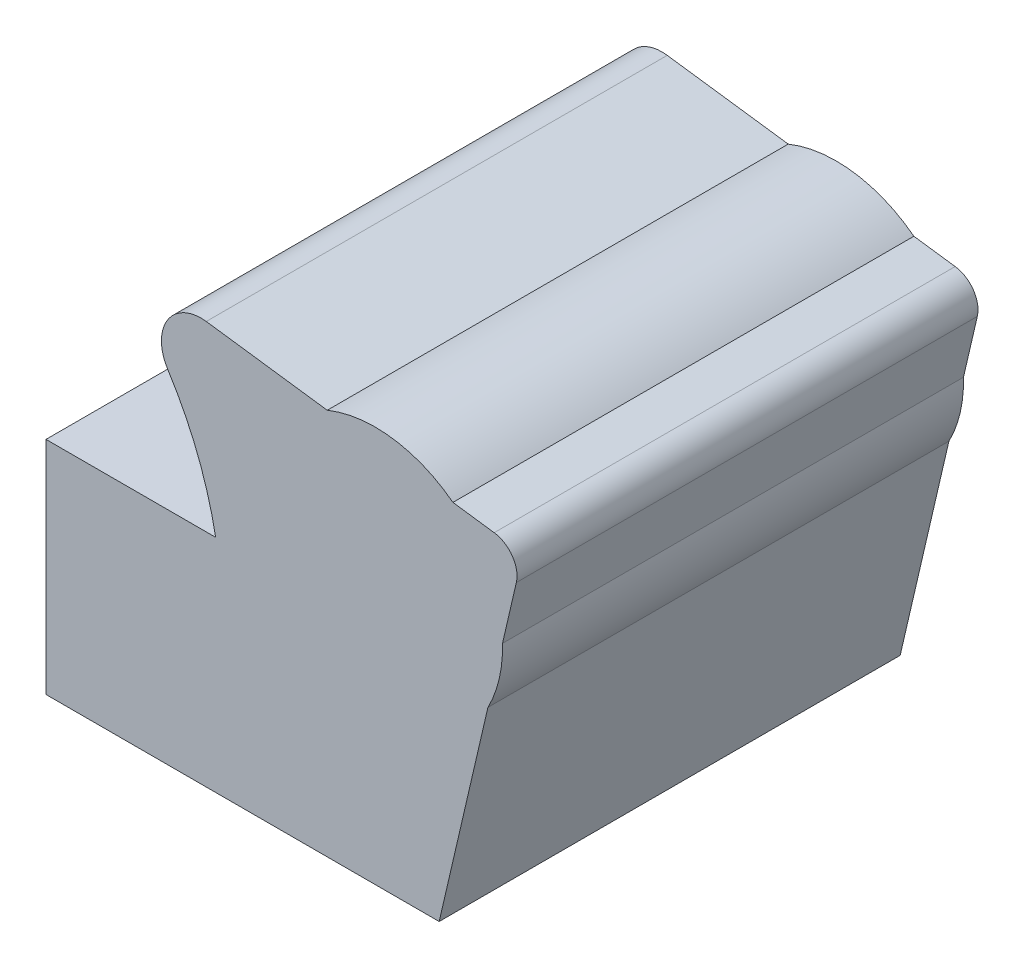
ISO-10303-21;
HEADER;
FILE_DESCRIPTION(('STEP AP214'),'2;1');
FILE_NAME('part.step','',(''),(''),'','','');
FILE_SCHEMA(('AUTOMOTIVE_DESIGN { 1 0 10303 214 1 1 1 1 }'));
ENDSEC;
DATA;
#1=APPLICATION_CONTEXT('core data for automotive mechanical design processes');
#2=APPLICATION_PROTOCOL_DEFINITION('international standard','automotive_design',2000,#1);
#3=PRODUCT_CONTEXT('',#1,'mechanical');
#4=PRODUCT('Part','Part','',(#3));
#5=PRODUCT_RELATED_PRODUCT_CATEGORY('part','',(#4));
#6=PRODUCT_DEFINITION_FORMATION('','',#4);
#7=PRODUCT_DEFINITION_CONTEXT('part definition',#1,'design');
#8=PRODUCT_DEFINITION('design','',#6,#7);
#9=PRODUCT_DEFINITION_SHAPE('','',#8);
#10=(LENGTH_UNIT() NAMED_UNIT(*) SI_UNIT(.MILLI.,.METRE.));
#11=(NAMED_UNIT(*) PLANE_ANGLE_UNIT() SI_UNIT($,.RADIAN.));
#12=(NAMED_UNIT(*) SI_UNIT($,.STERADIAN.) SOLID_ANGLE_UNIT());
#13=UNCERTAINTY_MEASURE_WITH_UNIT(LENGTH_MEASURE(1.E-05),#10,'distance_accuracy_value','');
#14=(GEOMETRIC_REPRESENTATION_CONTEXT(3) GLOBAL_UNCERTAINTY_ASSIGNED_CONTEXT((#13)) GLOBAL_UNIT_ASSIGNED_CONTEXT((#10,
#11,#12)) REPRESENTATION_CONTEXT('',''));
#15=CARTESIAN_POINT('',(0.,0.,0.));
#16=DIRECTION('',(0.,0.,1.));
#17=DIRECTION('',(1.,0.,0.));
#18=AXIS2_PLACEMENT_3D('',#15,#16,#17);
#19=CARTESIAN_POINT('',(19.0917847936775,82.3258456075658,50.));
#20=DIRECTION('',(0.,0.,-1.));
#21=DIRECTION('',(-1.,0.,0.));
#22=AXIS2_PLACEMENT_3D('',#19,#20,#21);
#23=CYLINDRICAL_SURFACE('',#22,74.3600000001127);
#24=CARTESIAN_POINT('',(19.0917847936775,82.3258456075658,-50.));
#25=DIRECTION('',(0.,0.,1.));
#26=DIRECTION('',(1.,0.,0.));
#27=AXIS2_PLACEMENT_3D('',#24,#25,#26);
#28=CIRCLE('',#27,74.3600000001127);
#29=CARTESIAN_POINT('',(81.786119565483,122.311217777117,-50.));
#30=VERTEX_POINT('',#29);
#31=CARTESIAN_POINT('',(92.2028645129567,95.8971249244899,-50.));
#32=VERTEX_POINT('',#31);
#33=EDGE_CURVE('E239',#30,#32,#28,.F.);
#34=ORIENTED_EDGE('',*,*,#33,.T.);
#35=DIRECTION('',(0.,0.,-1.));
#36=VECTOR('',#35,1.);
#37=CARTESIAN_POINT('',(92.2028645129567,95.8971249244899,50.));
#38=LINE('',#37,#36);
#39=CARTESIAN_POINT('',(92.2028645129567,95.8971249244899,50.));
#40=VERTEX_POINT('',#39);
#41=EDGE_CURVE('E254',#40,#32,#38,.T.);
#42=ORIENTED_EDGE('',*,*,#41,.F.);
#43=CARTESIAN_POINT('',(19.0917847936775,82.3258456075658,50.));
#44=DIRECTION('',(0.,0.,1.));
#45=DIRECTION('',(1.,0.,0.));
#46=AXIS2_PLACEMENT_3D('',#43,#44,#45);
#47=CIRCLE('',#46,74.3600000001127);
#48=CARTESIAN_POINT('',(81.786119565483,122.311217777117,50.));
#49=VERTEX_POINT('',#48);
#50=EDGE_CURVE('E284',#49,#40,#47,.F.);
#51=ORIENTED_EDGE('',*,*,#50,.F.);
#52=DIRECTION('',(0.,0.,-1.));
#53=VECTOR('',#52,1.);
#54=CARTESIAN_POINT('',(81.786119565483,122.311217777117,50.));
#55=LINE('',#54,#53);
#56=EDGE_CURVE('E256',#49,#30,#55,.T.);
#57=ORIENTED_EDGE('',*,*,#56,.T.);
#58=EDGE_LOOP('',(#34,#42,#51,#57));
#59=FACE_BOUND('',#58,.T.);
#60=ADVANCED_FACE('F92',(#59),#23,.F.);
#61=CARTESIAN_POINT('',(89.0200812699105,126.924914565904,50.));
#62=DIRECTION('',(0.,0.,-1.));
#63=DIRECTION('',(-1.,0.,0.));
#64=AXIS2_PLACEMENT_3D('',#61,#62,#63);
#65=CYLINDRICAL_SURFACE('',#64,8.57999999999931);
#66=CARTESIAN_POINT('',(89.0200812699105,126.924914565904,-50.));
#67=DIRECTION('',(0.,0.,1.));
#68=DIRECTION('',(1.,0.,0.));
#69=AXIS2_PLACEMENT_3D('',#66,#67,#68);
#70=CIRCLE('',#69,8.57999999999931);
#71=CARTESIAN_POINT('',(90.1698066016005,135.427533671901,-50.));
#72=VERTEX_POINT('',#71);
#73=EDGE_CURVE('E237',#72,#30,#70,.T.);
#74=ORIENTED_EDGE('',*,*,#73,.T.);
#75=ORIENTED_EDGE('',*,*,#56,.F.);
#76=CARTESIAN_POINT('',(89.0200812699105,126.924914565904,50.));
#77=DIRECTION('',(0.,0.,1.));
#78=DIRECTION('',(1.,0.,0.));
#79=AXIS2_PLACEMENT_3D('',#76,#77,#78);
#80=CIRCLE('',#79,8.57999999999931);
#81=CARTESIAN_POINT('',(90.1698066016005,135.427533671901,50.));
#82=VERTEX_POINT('',#81);
#83=EDGE_CURVE('E282',#82,#49,#80,.T.);
#84=ORIENTED_EDGE('',*,*,#83,.F.);
#85=DIRECTION('',(0.,0.,-1.));
#86=VECTOR('',#85,1.);
#87=CARTESIAN_POINT('',(90.1698066016005,135.427533671901,50.));
#88=LINE('',#87,#86);
#89=EDGE_CURVE('E259',#82,#72,#88,.T.);
#90=ORIENTED_EDGE('',*,*,#89,.T.);
#91=EDGE_LOOP('',(#74,#75,#84,#90));
#92=FACE_BOUND('',#91,.T.);
#93=ADVANCED_FACE('F280',(#92),#65,.T.);
#94=CARTESIAN_POINT('',(19.6028110655159,144.969612569904,50.));
#95=DIRECTION('',(-0.134000621409096,-0.990981247785232,0.));
#96=DIRECTION('',(0.990981247785232,-0.134000621409096,0.));
#97=AXIS2_PLACEMENT_3D('',#94,#95,#96);
#98=PLANE('',#97);
#99=DIRECTION('',(-0.990981247785232,0.134000621409096,0.));
#100=VECTOR('',#99,1.);
#101=CARTESIAN_POINT('',(19.6028110655159,144.969612569904,-50.));
#102=LINE('',#101,#100);
#103=CARTESIAN_POINT('',(116.418600533637,131.878168125385,-50.));
#104=VERTEX_POINT('',#103);
#105=EDGE_CURVE('E235',#104,#72,#102,.T.);
#106=ORIENTED_EDGE('',*,*,#105,.T.);
#107=ORIENTED_EDGE('',*,*,#89,.F.);
#108=DIRECTION('',(-0.990981247785232,0.134000621409096,0.));
#109=VECTOR('',#108,1.);
#110=CARTESIAN_POINT('',(19.6028110655159,144.969612569904,50.));
#111=LINE('',#110,#109);
#112=CARTESIAN_POINT('',(116.418600533637,131.878168125385,50.));
#113=VERTEX_POINT('',#112);
#114=EDGE_CURVE('E285',#113,#82,#111,.T.);
#115=ORIENTED_EDGE('',*,*,#114,.F.);
#116=DIRECTION('',(0.,0.,-1.));
#117=VECTOR('',#116,1.);
#118=CARTESIAN_POINT('',(116.418600533637,131.878168125385,50.));
#119=LINE('',#118,#117);
#120=EDGE_CURVE('E262',#113,#104,#119,.T.);
#121=ORIENTED_EDGE('',*,*,#120,.T.);
#122=EDGE_LOOP('',(#106,#107,#115,#121));
#123=FACE_BOUND('',#122,.T.);
#124=ADVANCED_FACE('F276',(#123),#98,.F.);
#125=CARTESIAN_POINT('',(126.840999999996,106.3205,50.));
#126=DIRECTION('',(0.,0.,-1.));
#127=DIRECTION('',(-1.,0.,0.));
#128=AXIS2_PLACEMENT_3D('',#125,#126,#127);
#129=CYLINDRICAL_SURFACE('',#128,27.6011016201112);
#130=CARTESIAN_POINT('',(126.840999999996,106.3205,-50.));
#131=DIRECTION('',(0.,0.,1.));
#132=DIRECTION('',(1.,0.,0.));
#133=AXIS2_PLACEMENT_3D('',#130,#131,#132);
#134=CIRCLE('',#133,27.6011016201112);
#135=CARTESIAN_POINT('',(143.676819781968,128.192307947965,-50.));
#136=VERTEX_POINT('',#135);
#137=EDGE_CURVE('E232',#136,#104,#134,.T.);
#138=ORIENTED_EDGE('',*,*,#137,.T.);
#139=ORIENTED_EDGE('',*,*,#120,.F.);
#140=CARTESIAN_POINT('',(126.840999999996,106.3205,50.));
#141=DIRECTION('',(0.,0.,1.));
#142=DIRECTION('',(1.,0.,0.));
#143=AXIS2_PLACEMENT_3D('',#140,#141,#142);
#144=CIRCLE('',#143,27.6011016201112);
#145=CARTESIAN_POINT('',(143.676819781968,128.192307947965,50.));
#146=VERTEX_POINT('',#145);
#147=EDGE_CURVE('E269',#146,#113,#144,.T.);
#148=ORIENTED_EDGE('',*,*,#147,.F.);
#149=DIRECTION('',(0.,0.,-1.));
#150=VECTOR('',#149,1.);
#151=CARTESIAN_POINT('',(143.676819781968,128.192307947965,50.));
#152=LINE('',#151,#150);
#153=EDGE_CURVE('E210',#146,#136,#152,.T.);
#154=ORIENTED_EDGE('',*,*,#153,.T.);
#155=EDGE_LOOP('',(#138,#139,#148,#154));
#156=FACE_BOUND('',#155,.T.);
#157=ADVANCED_FACE('F265',(#156),#129,.T.);
#158=CARTESIAN_POINT('',(19.6028110655159,144.969612569904,50.));
#159=DIRECTION('',(-0.134000621409096,-0.990981247785232,0.));
#160=DIRECTION('',(0.990981247785232,-0.134000621409096,0.));
#161=AXIS2_PLACEMENT_3D('',#158,#159,#160);
#162=PLANE('',#161);
#163=DIRECTION('',(-0.990981247785232,0.134000621409096,0.));
#164=VECTOR('',#163,1.);
#165=CARTESIAN_POINT('',(19.6028110655159,144.969612569904,-50.));
#166=LINE('',#165,#164);
#167=CARTESIAN_POINT('',(152.63248355446,126.981321853801,-50.));
#168=VERTEX_POINT('',#167);
#169=EDGE_CURVE('E229',#168,#136,#166,.T.);
#170=ORIENTED_EDGE('',*,*,#169,.T.);
#171=ORIENTED_EDGE('',*,*,#153,.F.);
#172=DIRECTION('',(-0.990981247785232,0.134000621409096,0.));
#173=VECTOR('',#172,1.);
#174=CARTESIAN_POINT('',(19.6028110655159,144.969612569904,50.));
#175=LINE('',#174,#173);
#176=CARTESIAN_POINT('',(152.63248355446,126.981321853801,50.));
#177=VERTEX_POINT('',#176);
#178=EDGE_CURVE('E201',#177,#146,#175,.T.);
#179=ORIENTED_EDGE('',*,*,#178,.F.);
#180=DIRECTION('',(0.,0.,-1.));
#181=VECTOR('',#180,1.);
#182=CARTESIAN_POINT('',(152.63248355446,126.981321853801,50.));
#183=LINE('',#182,#181);
#184=EDGE_CURVE('E199',#177,#168,#183,.T.);
#185=ORIENTED_EDGE('',*,*,#184,.T.);
#186=EDGE_LOOP('',(#170,#171,#179,#185));
#187=FACE_BOUND('',#186,.T.);
#188=ADVANCED_FACE('F271',(#187),#162,.F.);
#189=CARTESIAN_POINT('',(151.866,121.31290911647,50.));
#190=DIRECTION('',(0.,0.,-1.));
#191=DIRECTION('',(-1.,0.,0.));
#192=AXIS2_PLACEMENT_3D('',#189,#190,#191);
#193=CYLINDRICAL_SURFACE('',#192,5.71999999999941);
#194=CARTESIAN_POINT('',(151.866,121.31290911647,-50.));
#195=DIRECTION('',(0.,0.,1.));
#196=DIRECTION('',(1.,0.,0.));
#197=AXIS2_PLACEMENT_3D('',#194,#195,#196);
#198=CIRCLE('',#197,5.71999999999941);
#199=CARTESIAN_POINT('',(157.437634446656,120.01857933128,-50.));
#200=VERTEX_POINT('',#199);
#201=EDGE_CURVE('E222',#200,#168,#198,.T.);
#202=ORIENTED_EDGE('',*,*,#201,.T.);
#203=ORIENTED_EDGE('',*,*,#184,.F.);
#204=CARTESIAN_POINT('',(151.866,121.31290911647,50.));
#205=DIRECTION('',(0.,0.,1.));
#206=DIRECTION('',(1.,0.,0.));
#207=AXIS2_PLACEMENT_3D('',#204,#205,#206);
#208=CIRCLE('',#207,5.71999999999941);
#209=CARTESIAN_POINT('',(157.437634446656,120.01857933128,50.));
#210=VERTEX_POINT('',#209);
#211=EDGE_CURVE('E185',#210,#177,#208,.T.);
#212=ORIENTED_EDGE('',*,*,#211,.F.);
#213=DIRECTION('',(0.,0.,-1.));
#214=VECTOR('',#213,1.);
#215=CARTESIAN_POINT('',(157.437634446656,120.01857933128,50.));
#216=LINE('',#215,#214);
#217=EDGE_CURVE('E197',#210,#200,#216,.T.);
#218=ORIENTED_EDGE('',*,*,#217,.T.);
#219=EDGE_LOOP('',(#202,#203,#212,#218));
#220=FACE_BOUND('',#219,.T.);
#221=ADVANCED_FACE('F196',(#220),#193,.T.);
#222=CARTESIAN_POINT('',(122.922758843375,-28.5558195843682,50.));
#223=DIRECTION('',(-0.974061966198679,0.226281430977365,0.));
#224=DIRECTION('',(-0.226281430977365,-0.974061966198679,0.));
#225=AXIS2_PLACEMENT_3D('',#222,#223,#224);
#226=PLANE('',#225);
#227=DIRECTION('',(0.,0.,-1.));
#228=VECTOR('',#227,1.);
#229=CARTESIAN_POINT('',(154.431677752707,107.078993104652,50.));
#230=LINE('',#229,#228);
#231=CARTESIAN_POINT('',(154.431677752707,107.078993104652,-50.));
#232=VERTEX_POINT('',#231);
#233=CARTESIAN_POINT('',(154.431677752707,107.078993104652,50.));
#234=VERTEX_POINT('',#233);
#235=EDGE_CURVE('E100',#232,#234,#230,.F.);
#236=ORIENTED_EDGE('',*,*,#235,.F.);
#237=DIRECTION('',(0.226281430977365,0.974061966198679,0.));
#238=VECTOR('',#237,1.);
#239=CARTESIAN_POINT('',(122.922758843375,-28.5558195843682,-50.));
#240=LINE('',#239,#238);
#241=EDGE_CURVE('E205',#232,#200,#240,.T.);
#242=ORIENTED_EDGE('',*,*,#241,.T.);
#243=ORIENTED_EDGE('',*,*,#217,.F.);
#244=DIRECTION('',(0.226281430977365,0.974061966198679,0.));
#245=VECTOR('',#244,1.);
#246=CARTESIAN_POINT('',(122.922758843375,-28.5558195843682,50.));
#247=LINE('',#246,#245);
#248=EDGE_CURVE('E180',#234,#210,#247,.T.);
#249=ORIENTED_EDGE('',*,*,#248,.F.);
#250=EDGE_LOOP('',(#236,#242,#243,#249));
#251=FACE_BOUND('',#250,.T.);
#252=ADVANCED_FACE('F203',(#251),#226,.F.);
#253=CARTESIAN_POINT('',(126.840999999996,106.3205,50.));
#254=DIRECTION('',(0.,0.,-1.));
#255=DIRECTION('',(-1.,0.,0.));
#256=AXIS2_PLACEMENT_3D('',#253,#254,#255);
#257=CYLINDRICAL_SURFACE('',#256,27.6011016201112);
#258=CARTESIAN_POINT('',(126.840999999996,106.3205,-50.));
#259=DIRECTION('',(0.,0.,1.));
#260=DIRECTION('',(1.,0.,0.));
#261=AXIS2_PLACEMENT_3D('',#258,#259,#260);
#262=CIRCLE('',#261,27.6011016201112);
#263=CARTESIAN_POINT('',(151.271848854584,93.4770411633782,-50.));
#264=VERTEX_POINT('',#263);
#265=EDGE_CURVE('E215',#264,#232,#262,.T.);
#266=ORIENTED_EDGE('',*,*,#265,.T.);
#267=ORIENTED_EDGE('',*,*,#235,.T.);
#268=CARTESIAN_POINT('',(126.840999999996,106.3205,50.));
#269=DIRECTION('',(0.,0.,1.));
#270=DIRECTION('',(1.,0.,0.));
#271=AXIS2_PLACEMENT_3D('',#268,#269,#270);
#272=CIRCLE('',#271,27.6011016201112);
#273=CARTESIAN_POINT('',(151.271848854584,93.4770411633782,50.));
#274=VERTEX_POINT('',#273);
#275=EDGE_CURVE('E189',#274,#234,#272,.T.);
#276=ORIENTED_EDGE('',*,*,#275,.F.);
#277=DIRECTION('',(0.,0.,-1.));
#278=VECTOR('',#277,1.);
#279=CARTESIAN_POINT('',(151.271848854584,93.4770411633782,50.));
#280=LINE('',#279,#278);
#281=EDGE_CURVE('E207',#274,#264,#280,.T.);
#282=ORIENTED_EDGE('',*,*,#281,.T.);
#283=EDGE_LOOP('',(#266,#267,#276,#282));
#284=FACE_BOUND('',#283,.T.);
#285=ADVANCED_FACE('F94',(#284),#257,.T.);
#286=CARTESIAN_POINT('',(0.,95.8971249244899,50.));
#287=DIRECTION('',(0.,1.,0.));
#288=DIRECTION('',(0.,0.,1.));
#289=AXIS2_PLACEMENT_3D('',#286,#287,#288);
#290=PLANE('',#289);
#291=DIRECTION('',(1.,0.,0.));
#292=VECTOR('',#291,1.);
#293=CARTESIAN_POINT('',(0.,95.8971249244899,-50.));
#294=LINE('',#293,#292);
#295=CARTESIAN_POINT('',(55.4044049790674,95.8971249244899,-50.));
#296=VERTEX_POINT('',#295);
#297=EDGE_CURVE('E242',#296,#32,#294,.T.);
#298=ORIENTED_EDGE('',*,*,#297,.F.);
#299=DIRECTION('',(0.,0.,-1.));
#300=VECTOR('',#299,1.);
#301=CARTESIAN_POINT('',(55.4044049790674,95.8971249244899,50.));
#302=LINE('',#301,#300);
#303=CARTESIAN_POINT('',(55.4044049790674,95.8971249244899,50.));
#304=VERTEX_POINT('',#303);
#305=EDGE_CURVE('E251',#304,#296,#302,.T.);
#306=ORIENTED_EDGE('',*,*,#305,.F.);
#307=DIRECTION('',(1.,0.,0.));
#308=VECTOR('',#307,1.);
#309=CARTESIAN_POINT('',(0.,95.8971249244899,50.));
#310=LINE('',#309,#308);
#311=EDGE_CURVE('E287',#304,#40,#310,.T.);
#312=ORIENTED_EDGE('',*,*,#311,.T.);
#313=ORIENTED_EDGE('',*,*,#41,.T.);
#314=EDGE_LOOP('',(#298,#306,#312,#313));
#315=FACE_BOUND('',#314,.T.);
#316=ADVANCED_FACE('F308',(#315),#290,.T.);
#317=CARTESIAN_POINT('',(0.,0.,50.));
#318=DIRECTION('',(0.,0.,1.));
#319=DIRECTION('',(1.,0.,0.));
#320=AXIS2_PLACEMENT_3D('',#317,#318,#319);
#321=PLANE('',#320);
#322=DIRECTION('',(0.,1.,0.));
#323=VECTOR('',#322,1.);
#324=CARTESIAN_POINT('',(55.4044049790674,0.,50.));
#325=LINE('',#324,#323);
#326=CARTESIAN_POINT('',(55.4044049790674,47.9623912919101,50.));
#327=VERTEX_POINT('',#326);
#328=EDGE_CURVE('E293',#327,#304,#325,.T.);
#329=ORIENTED_EDGE('',*,*,#328,.F.);
#330=DIRECTION('',(1.,0.,0.));
#331=VECTOR('',#330,1.);
#332=CARTESIAN_POINT('',(0.,47.9623912919101,50.));
#333=LINE('',#332,#331);
#334=CARTESIAN_POINT('',(140.698476255362,47.9623912919101,50.));
#335=VERTEX_POINT('',#334);
#336=EDGE_CURVE('E113',#327,#335,#333,.T.);
#337=ORIENTED_EDGE('',*,*,#336,.T.);
#338=EDGE_CURVE('E192',#335,#274,#247,.T.);
#339=ORIENTED_EDGE('',*,*,#338,.T.);
#340=ORIENTED_EDGE('',*,*,#275,.T.);
#341=ORIENTED_EDGE('',*,*,#248,.T.);
#342=ORIENTED_EDGE('',*,*,#211,.T.);
#343=ORIENTED_EDGE('',*,*,#178,.T.);
#344=ORIENTED_EDGE('',*,*,#147,.T.);
#345=ORIENTED_EDGE('',*,*,#114,.T.);
#346=ORIENTED_EDGE('',*,*,#83,.T.);
#347=ORIENTED_EDGE('',*,*,#50,.T.);
#348=ORIENTED_EDGE('',*,*,#311,.F.);
#349=EDGE_LOOP('',(#329,#337,#339,#340,#341,#342,#343,#344,#345,#346,#347,#348));
#350=FACE_BOUND('',#349,.T.);
#351=ADVANCED_FACE('F183',(#350),#321,.T.);
#352=ORIENTED_EDGE('',*,*,#281,.F.);
#353=ORIENTED_EDGE('',*,*,#338,.F.);
#354=DIRECTION('',(0.,0.,-1.));
#355=VECTOR('',#354,1.);
#356=CARTESIAN_POINT('',(140.698476255362,47.9623912919101,50.));
#357=LINE('',#356,#355);
#358=CARTESIAN_POINT('',(140.698476255362,47.9623912919101,-50.));
#359=VERTEX_POINT('',#358);
#360=EDGE_CURVE('E248',#335,#359,#357,.T.);
#361=ORIENTED_EDGE('',*,*,#360,.T.);
#362=EDGE_CURVE('E223',#359,#264,#240,.T.);
#363=ORIENTED_EDGE('',*,*,#362,.T.);
#364=EDGE_LOOP('',(#352,#353,#361,#363));
#365=FACE_BOUND('',#364,.T.);
#366=ADVANCED_FACE('F300',(#365),#226,.F.);
#367=CARTESIAN_POINT('',(0.,0.,-50.));
#368=DIRECTION('',(0.,0.,1.));
#369=DIRECTION('',(1.,0.,0.));
#370=AXIS2_PLACEMENT_3D('',#367,#368,#369);
#371=PLANE('',#370);
#372=DIRECTION('',(1.,0.,0.));
#373=VECTOR('',#372,1.);
#374=CARTESIAN_POINT('',(0.,47.9623912919101,-50.));
#375=LINE('',#374,#373);
#376=CARTESIAN_POINT('',(55.4044049790674,47.9623912919101,-50.));
#377=VERTEX_POINT('',#376);
#378=EDGE_CURVE('E107',#377,#359,#375,.T.);
#379=ORIENTED_EDGE('',*,*,#378,.F.);
#380=DIRECTION('',(0.,1.,0.));
#381=VECTOR('',#380,1.);
#382=CARTESIAN_POINT('',(55.4044049790674,0.,-50.));
#383=LINE('',#382,#381);
#384=EDGE_CURVE('E245',#377,#296,#383,.T.);
#385=ORIENTED_EDGE('',*,*,#384,.T.);
#386=ORIENTED_EDGE('',*,*,#297,.T.);
#387=ORIENTED_EDGE('',*,*,#33,.F.);
#388=ORIENTED_EDGE('',*,*,#73,.F.);
#389=ORIENTED_EDGE('',*,*,#105,.F.);
#390=ORIENTED_EDGE('',*,*,#137,.F.);
#391=ORIENTED_EDGE('',*,*,#169,.F.);
#392=ORIENTED_EDGE('',*,*,#201,.F.);
#393=ORIENTED_EDGE('',*,*,#241,.F.);
#394=ORIENTED_EDGE('',*,*,#265,.F.);
#395=ORIENTED_EDGE('',*,*,#362,.F.);
#396=EDGE_LOOP('',(#379,#385,#386,#387,#388,#389,#390,#391,#392,#393,#394,#395));
#397=FACE_BOUND('',#396,.T.);
#398=ADVANCED_FACE('F220',(#397),#371,.F.);
#399=CARTESIAN_POINT('',(0.,47.9623912919101,50.));
#400=DIRECTION('',(0.,1.,0.));
#401=DIRECTION('',(0.,0.,1.));
#402=AXIS2_PLACEMENT_3D('',#399,#400,#401);
#403=PLANE('',#402);
#404=ORIENTED_EDGE('',*,*,#378,.T.);
#405=ORIENTED_EDGE('',*,*,#360,.F.);
#406=ORIENTED_EDGE('',*,*,#336,.F.);
#407=DIRECTION('',(0.,0.,-1.));
#408=VECTOR('',#407,1.);
#409=CARTESIAN_POINT('',(55.4044049790674,47.9623912919101,50.));
#410=LINE('',#409,#408);
#411=EDGE_CURVE('E12',#327,#377,#410,.T.);
#412=ORIENTED_EDGE('',*,*,#411,.T.);
#413=EDGE_LOOP('',(#404,#405,#406,#412));
#414=FACE_BOUND('',#413,.T.);
#415=ADVANCED_FACE('F298',(#414),#403,.F.);
#416=CARTESIAN_POINT('',(55.4044049790674,0.,50.));
#417=DIRECTION('',(-1.,0.,0.));
#418=DIRECTION('',(0.,-1.,0.));
#419=AXIS2_PLACEMENT_3D('',#416,#417,#418);
#420=PLANE('',#419);
#421=ORIENTED_EDGE('',*,*,#411,.F.);
#422=ORIENTED_EDGE('',*,*,#328,.T.);
#423=ORIENTED_EDGE('',*,*,#305,.T.);
#424=ORIENTED_EDGE('',*,*,#384,.F.);
#425=EDGE_LOOP('',(#421,#422,#423,#424));
#426=FACE_BOUND('',#425,.T.);
#427=ADVANCED_FACE('F312',(#426),#420,.T.);
#428=CLOSED_SHELL('',(#60,#93,#124,#157,#188,#221,#252,#285,#316,#351,#366,#398,#415,#427));
#429=MANIFOLD_SOLID_BREP('B2',#428);
#430=ADVANCED_BREP_SHAPE_REPRESENTATION('',(#18,#429),#14);
#431=SHAPE_DEFINITION_REPRESENTATION(#9,#430);
ENDSEC;
END-ISO-10303-21;
